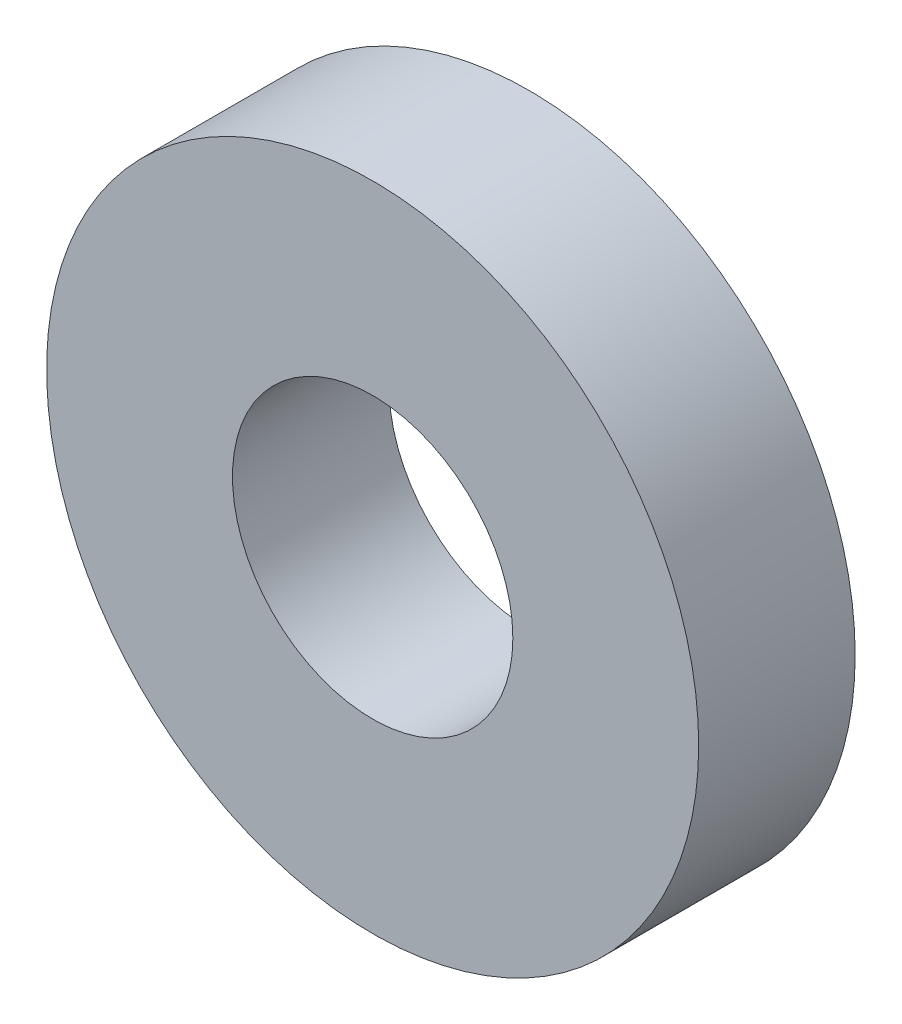
ISO-10303-21;
HEADER;
FILE_DESCRIPTION(('STEP AP214'),'2;1');
FILE_NAME('part.step','',(''),(''),'','','');
FILE_SCHEMA(('AUTOMOTIVE_DESIGN { 1 0 10303 214 1 1 1 1 }'));
ENDSEC;
DATA;
#1=APPLICATION_CONTEXT('core data for automotive mechanical design processes');
#2=APPLICATION_PROTOCOL_DEFINITION('international standard','automotive_design',2000,#1);
#3=PRODUCT_CONTEXT('',#1,'mechanical');
#4=PRODUCT('Part','Part','',(#3));
#5=PRODUCT_RELATED_PRODUCT_CATEGORY('part','',(#4));
#6=PRODUCT_DEFINITION_FORMATION('','',#4);
#7=PRODUCT_DEFINITION_CONTEXT('part definition',#1,'design');
#8=PRODUCT_DEFINITION('design','',#6,#7);
#9=PRODUCT_DEFINITION_SHAPE('','',#8);
#10=(LENGTH_UNIT() NAMED_UNIT(*) SI_UNIT(.MILLI.,.METRE.));
#11=(NAMED_UNIT(*) PLANE_ANGLE_UNIT() SI_UNIT($,.RADIAN.));
#12=(NAMED_UNIT(*) SI_UNIT($,.STERADIAN.) SOLID_ANGLE_UNIT());
#13=UNCERTAINTY_MEASURE_WITH_UNIT(LENGTH_MEASURE(1.E-05),#10,'distance_accuracy_value','');
#14=(GEOMETRIC_REPRESENTATION_CONTEXT(3) GLOBAL_UNCERTAINTY_ASSIGNED_CONTEXT((#13)) GLOBAL_UNIT_ASSIGNED_CONTEXT((#10,
#11,#12)) REPRESENTATION_CONTEXT('',''));
#15=CARTESIAN_POINT('',(0.,0.,0.));
#16=DIRECTION('',(0.,0.,1.));
#17=DIRECTION('',(1.,0.,0.));
#18=AXIS2_PLACEMENT_3D('',#15,#16,#17);
#19=CARTESIAN_POINT('',(0.,0.,2.4));
#20=DIRECTION('',(0.,0.,1.));
#21=DIRECTION('',(1.,0.,0.));
#22=AXIS2_PLACEMENT_3D('',#19,#20,#21);
#23=PLANE('',#22);
#24=CARTESIAN_POINT('',(0.,0.,2.4));
#25=DIRECTION('',(0.,0.,1.));
#26=DIRECTION('',(1.,0.,0.));
#27=AXIS2_PLACEMENT_3D('',#24,#25,#26);
#28=CIRCLE('',#27,5.);
#29=CARTESIAN_POINT('',(5.,0.,2.4));
#30=VERTEX_POINT('',#29);
#31=EDGE_CURVE('E10',#30,#30,#28,.T.);
#32=ORIENTED_EDGE('',*,*,#31,.T.);
#33=EDGE_LOOP('',(#32));
#34=FACE_BOUND('',#33,.T.);
#35=CARTESIAN_POINT('',(0.,0.,2.4));
#36=DIRECTION('',(0.,0.,1.));
#37=DIRECTION('',(1.,0.,0.));
#38=AXIS2_PLACEMENT_3D('',#35,#36,#37);
#39=CIRCLE('',#38,2.15);
#40=CARTESIAN_POINT('',(2.15,0.,2.4));
#41=VERTEX_POINT('',#40);
#42=EDGE_CURVE('E43',#41,#41,#39,.T.);
#43=ORIENTED_EDGE('',*,*,#42,.F.);
#44=EDGE_LOOP('',(#43));
#45=FACE_BOUND('',#44,.T.);
#46=ADVANCED_FACE('F32',(#34,#45),#23,.T.);
#47=CARTESIAN_POINT('',(0.,0.,0.));
#48=DIRECTION('',(0.,0.,1.));
#49=DIRECTION('',(1.,0.,0.));
#50=AXIS2_PLACEMENT_3D('',#47,#48,#49);
#51=PLANE('',#50);
#52=CARTESIAN_POINT('',(0.,0.,0.));
#53=DIRECTION('',(0.,0.,1.));
#54=DIRECTION('',(1.,0.,0.));
#55=AXIS2_PLACEMENT_3D('',#52,#53,#54);
#56=CIRCLE('',#55,5.);
#57=CARTESIAN_POINT('',(5.,0.,0.));
#58=VERTEX_POINT('',#57);
#59=EDGE_CURVE('E36',#58,#58,#56,.T.);
#60=ORIENTED_EDGE('',*,*,#59,.F.);
#61=EDGE_LOOP('',(#60));
#62=FACE_BOUND('',#61,.T.);
#63=CARTESIAN_POINT('',(0.,0.,0.));
#64=DIRECTION('',(0.,0.,1.));
#65=DIRECTION('',(1.,0.,0.));
#66=AXIS2_PLACEMENT_3D('',#63,#64,#65);
#67=CIRCLE('',#66,2.15);
#68=CARTESIAN_POINT('',(2.15,0.,0.));
#69=VERTEX_POINT('',#68);
#70=EDGE_CURVE('E45',#69,#69,#67,.T.);
#71=ORIENTED_EDGE('',*,*,#70,.T.);
#72=EDGE_LOOP('',(#71));
#73=FACE_BOUND('',#72,.T.);
#74=ADVANCED_FACE('F55',(#62,#73),#51,.F.);
#75=CARTESIAN_POINT('',(0.,0.,2.4));
#76=DIRECTION('',(0.,0.,-1.));
#77=DIRECTION('',(-1.,0.,0.));
#78=AXIS2_PLACEMENT_3D('',#75,#76,#77);
#79=CYLINDRICAL_SURFACE('',#78,5.);
#80=ORIENTED_EDGE('',*,*,#31,.F.);
#81=EDGE_LOOP('',(#80));
#82=FACE_BOUND('',#81,.T.);
#83=ORIENTED_EDGE('',*,*,#59,.T.);
#84=EDGE_LOOP('',(#83));
#85=FACE_BOUND('',#84,.T.);
#86=ADVANCED_FACE('F34',(#82,#85),#79,.T.);
#87=CARTESIAN_POINT('',(0.,0.,2.4));
#88=DIRECTION('',(0.,0.,-1.));
#89=DIRECTION('',(-1.,0.,0.));
#90=AXIS2_PLACEMENT_3D('',#87,#88,#89);
#91=CYLINDRICAL_SURFACE('',#90,2.15);
#92=ORIENTED_EDGE('',*,*,#42,.T.);
#93=EDGE_LOOP('',(#92));
#94=FACE_BOUND('',#93,.T.);
#95=ORIENTED_EDGE('',*,*,#70,.F.);
#96=EDGE_LOOP('',(#95));
#97=FACE_BOUND('',#96,.T.);
#98=ADVANCED_FACE('F51',(#94,#97),#91,.F.);
#99=CLOSED_SHELL('',(#46,#74,#86,#98));
#100=MANIFOLD_SOLID_BREP('B2',#99);
#101=ADVANCED_BREP_SHAPE_REPRESENTATION('',(#18,#100),#14);
#102=SHAPE_DEFINITION_REPRESENTATION(#9,#101);
ENDSEC;
END-ISO-10303-21;
